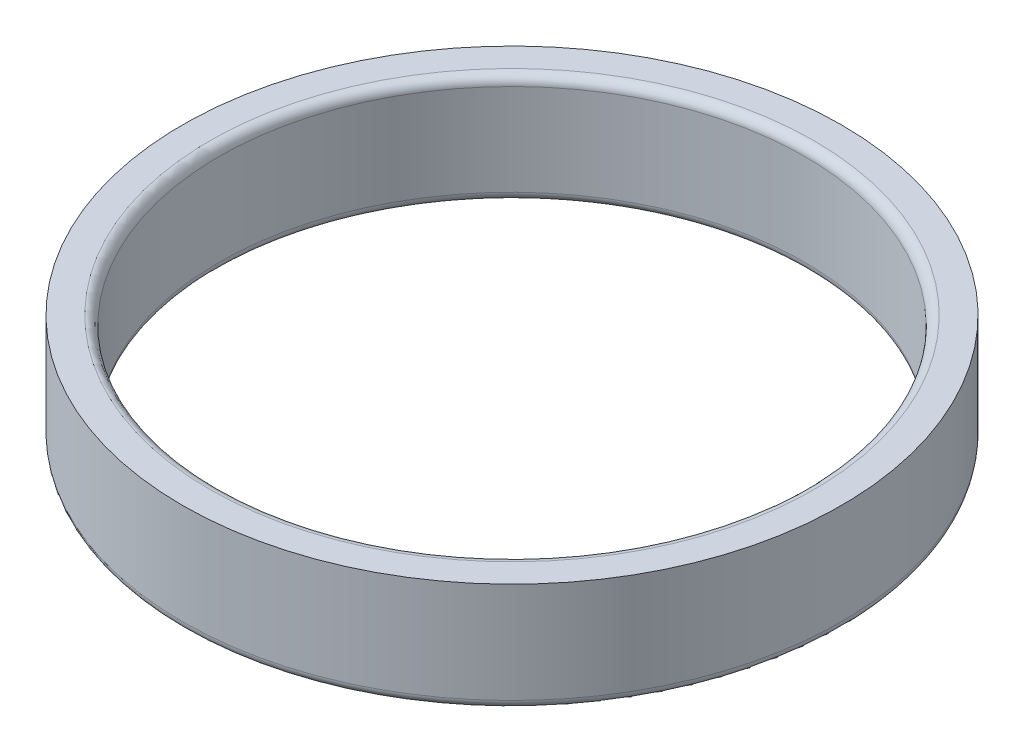
ISO-10303-21;
HEADER;
FILE_DESCRIPTION(('STEP AP214'),'2;1');
FILE_NAME('part.step','',(''),(''),'','','');
FILE_SCHEMA(('AUTOMOTIVE_DESIGN { 1 0 10303 214 1 1 1 1 }'));
ENDSEC;
DATA;
#1=APPLICATION_CONTEXT('core data for automotive mechanical design processes');
#2=APPLICATION_PROTOCOL_DEFINITION('international standard','automotive_design',2000,#1);
#3=PRODUCT_CONTEXT('',#1,'mechanical');
#4=PRODUCT('Part','Part','',(#3));
#5=PRODUCT_RELATED_PRODUCT_CATEGORY('part','',(#4));
#6=PRODUCT_DEFINITION_FORMATION('','',#4);
#7=PRODUCT_DEFINITION_CONTEXT('part definition',#1,'design');
#8=PRODUCT_DEFINITION('design','',#6,#7);
#9=PRODUCT_DEFINITION_SHAPE('','',#8);
#10=(LENGTH_UNIT() NAMED_UNIT(*) SI_UNIT(.MILLI.,.METRE.));
#11=(NAMED_UNIT(*) PLANE_ANGLE_UNIT() SI_UNIT($,.RADIAN.));
#12=(NAMED_UNIT(*) SI_UNIT($,.STERADIAN.) SOLID_ANGLE_UNIT());
#13=UNCERTAINTY_MEASURE_WITH_UNIT(LENGTH_MEASURE(1.E-05),#10,'distance_accuracy_value','');
#14=(GEOMETRIC_REPRESENTATION_CONTEXT(3) GLOBAL_UNCERTAINTY_ASSIGNED_CONTEXT((#13)) GLOBAL_UNIT_ASSIGNED_CONTEXT((#10,
#11,#12)) REPRESENTATION_CONTEXT('',''));
#15=CARTESIAN_POINT('',(0.,0.,0.));
#16=DIRECTION('',(0.,0.,1.));
#17=DIRECTION('',(1.,0.,0.));
#18=AXIS2_PLACEMENT_3D('',#15,#16,#17);
#19=CARTESIAN_POINT('',(0.,3.,0.));
#20=DIRECTION('',(0.,1.,0.));
#21=DIRECTION('',(0.,0.,1.));
#22=AXIS2_PLACEMENT_3D('',#19,#20,#21);
#23=PLANE('',#22);
#24=CARTESIAN_POINT('',(0.,3.,0.));
#25=DIRECTION('',(0.,1.,0.));
#26=DIRECTION('',(0.,0.,1.));
#27=AXIS2_PLACEMENT_3D('',#24,#25,#26);
#28=CIRCLE('',#27,8.25);
#29=CARTESIAN_POINT('',(0.,3.,8.25));
#30=VERTEX_POINT('',#29);
#31=EDGE_CURVE('E47',#30,#30,#28,.F.);
#32=ORIENTED_EDGE('',*,*,#31,.T.);
#33=EDGE_LOOP('',(#32));
#34=FACE_BOUND('',#33,.T.);
#35=CARTESIAN_POINT('',(0.,3.,0.));
#36=DIRECTION('',(0.,1.,0.));
#37=DIRECTION('',(0.,0.,1.));
#38=AXIS2_PLACEMENT_3D('',#35,#36,#37);
#39=CIRCLE('',#38,9.);
#40=CARTESIAN_POINT('',(0.,3.,9.));
#41=VERTEX_POINT('',#40);
#42=EDGE_CURVE('E58',#41,#41,#39,.T.);
#43=ORIENTED_EDGE('',*,*,#42,.T.);
#44=EDGE_LOOP('',(#43));
#45=FACE_BOUND('',#44,.T.);
#46=ADVANCED_FACE('F32',(#34,#45),#23,.T.);
#47=CARTESIAN_POINT('',(0.,0.,0.));
#48=DIRECTION('',(0.,1.,0.));
#49=DIRECTION('',(0.,0.,1.));
#50=AXIS2_PLACEMENT_3D('',#47,#48,#49);
#51=PLANE('',#50);
#52=CARTESIAN_POINT('',(0.,0.,0.));
#53=DIRECTION('',(0.,1.,0.));
#54=DIRECTION('',(0.,0.,1.));
#55=AXIS2_PLACEMENT_3D('',#52,#53,#54);
#56=CIRCLE('',#55,8.25);
#57=CARTESIAN_POINT('',(0.,0.,8.25));
#58=VERTEX_POINT('',#57);
#59=EDGE_CURVE('E39',#58,#58,#56,.T.);
#60=ORIENTED_EDGE('',*,*,#59,.T.);
#61=EDGE_LOOP('',(#60));
#62=FACE_BOUND('',#61,.T.);
#63=CARTESIAN_POINT('',(0.,0.,0.));
#64=DIRECTION('',(0.,1.,0.));
#65=DIRECTION('',(0.,0.,1.));
#66=AXIS2_PLACEMENT_3D('',#63,#64,#65);
#67=CIRCLE('',#66,8.75);
#68=CARTESIAN_POINT('',(0.,0.,8.75));
#69=VERTEX_POINT('',#68);
#70=EDGE_CURVE('E43',#69,#69,#67,.F.);
#71=ORIENTED_EDGE('',*,*,#70,.T.);
#72=EDGE_LOOP('',(#71));
#73=FACE_BOUND('',#72,.T.);
#74=ADVANCED_FACE('F66',(#62,#73),#51,.F.);
#75=CARTESIAN_POINT('',(0.,3.,0.));
#76=DIRECTION('',(0.,-1.,0.));
#77=DIRECTION('',(0.,0.,-1.));
#78=AXIS2_PLACEMENT_3D('',#75,#76,#77);
#79=CYLINDRICAL_SURFACE('',#78,9.);
#80=CARTESIAN_POINT('',(0.,0.25,0.));
#81=DIRECTION('',(0.,1.,0.));
#82=DIRECTION('',(0.,0.,1.));
#83=AXIS2_PLACEMENT_3D('',#80,#81,#82);
#84=CIRCLE('',#83,9.);
#85=CARTESIAN_POINT('',(0.,0.25,9.));
#86=VERTEX_POINT('',#85);
#87=EDGE_CURVE('E10',#86,#86,#84,.T.);
#88=ORIENTED_EDGE('',*,*,#87,.T.);
#89=EDGE_LOOP('',(#88));
#90=FACE_BOUND('',#89,.T.);
#91=ORIENTED_EDGE('',*,*,#42,.F.);
#92=EDGE_LOOP('',(#91));
#93=FACE_BOUND('',#92,.T.);
#94=ADVANCED_FACE('F63',(#90,#93),#79,.T.);
#95=CARTESIAN_POINT('',(0.,3.,0.));
#96=DIRECTION('',(0.,-1.,0.));
#97=DIRECTION('',(0.,0.,-1.));
#98=AXIS2_PLACEMENT_3D('',#95,#96,#97);
#99=CYLINDRICAL_SURFACE('',#98,8.);
#100=CARTESIAN_POINT('',(0.,2.75,0.));
#101=DIRECTION('',(0.,1.,0.));
#102=DIRECTION('',(0.,0.,1.));
#103=AXIS2_PLACEMENT_3D('',#100,#101,#102);
#104=CIRCLE('',#103,8.);
#105=CARTESIAN_POINT('',(0.,2.75,8.));
#106=VERTEX_POINT('',#105);
#107=EDGE_CURVE('E52',#106,#106,#104,.T.);
#108=ORIENTED_EDGE('',*,*,#107,.T.);
#109=EDGE_LOOP('',(#108));
#110=FACE_BOUND('',#109,.T.);
#111=CARTESIAN_POINT('',(0.,0.25,0.));
#112=DIRECTION('',(0.,1.,0.));
#113=DIRECTION('',(0.,0.,1.));
#114=AXIS2_PLACEMENT_3D('',#111,#112,#113);
#115=CIRCLE('',#114,8.);
#116=CARTESIAN_POINT('',(0.,0.25,8.));
#117=VERTEX_POINT('',#116);
#118=EDGE_CURVE('E55',#117,#117,#115,.F.);
#119=ORIENTED_EDGE('',*,*,#118,.T.);
#120=EDGE_LOOP('',(#119));
#121=FACE_BOUND('',#120,.T.);
#122=ADVANCED_FACE('F65',(#110,#121),#99,.F.);
#123=CARTESIAN_POINT('',(0.,2.75,0.));
#124=DIRECTION('',(0.,1.,0.));
#125=DIRECTION('',(0.,0.,1.));
#126=AXIS2_PLACEMENT_3D('',#123,#124,#125);
#127=TOROIDAL_SURFACE('',#126,8.25,0.25);
#128=ORIENTED_EDGE('',*,*,#31,.F.);
#129=EDGE_LOOP('',(#128));
#130=FACE_BOUND('',#129,.T.);
#131=ORIENTED_EDGE('',*,*,#107,.F.);
#132=EDGE_LOOP('',(#131));
#133=FACE_BOUND('',#132,.T.);
#134=ADVANCED_FACE('F72',(#130,#133),#127,.T.);
#135=CARTESIAN_POINT('',(0.,0.25,0.));
#136=DIRECTION('',(0.,1.,0.));
#137=DIRECTION('',(0.,0.,1.));
#138=AXIS2_PLACEMENT_3D('',#135,#136,#137);
#139=TOROIDAL_SURFACE('',#138,8.25,0.25);
#140=ORIENTED_EDGE('',*,*,#118,.F.);
#141=EDGE_LOOP('',(#140));
#142=FACE_BOUND('',#141,.T.);
#143=ORIENTED_EDGE('',*,*,#59,.F.);
#144=EDGE_LOOP('',(#143));
#145=FACE_BOUND('',#144,.T.);
#146=ADVANCED_FACE('F86',(#142,#145),#139,.T.);
#147=CARTESIAN_POINT('',(0.,0.25,0.));
#148=DIRECTION('',(0.,1.,0.));
#149=DIRECTION('',(0.,0.,1.));
#150=AXIS2_PLACEMENT_3D('',#147,#148,#149);
#151=TOROIDAL_SURFACE('',#150,8.75,0.25);
#152=ORIENTED_EDGE('',*,*,#70,.F.);
#153=EDGE_LOOP('',(#152));
#154=FACE_BOUND('',#153,.T.);
#155=ORIENTED_EDGE('',*,*,#87,.F.);
#156=EDGE_LOOP('',(#155));
#157=FACE_BOUND('',#156,.T.);
#158=ADVANCED_FACE('F34',(#154,#157),#151,.T.);
#159=CLOSED_SHELL('',(#46,#74,#94,#122,#134,#146,#158));
#160=MANIFOLD_SOLID_BREP('B2',#159);
#161=ADVANCED_BREP_SHAPE_REPRESENTATION('',(#18,#160),#14);
#162=SHAPE_DEFINITION_REPRESENTATION(#9,#161);
ENDSEC;
END-ISO-10303-21;
